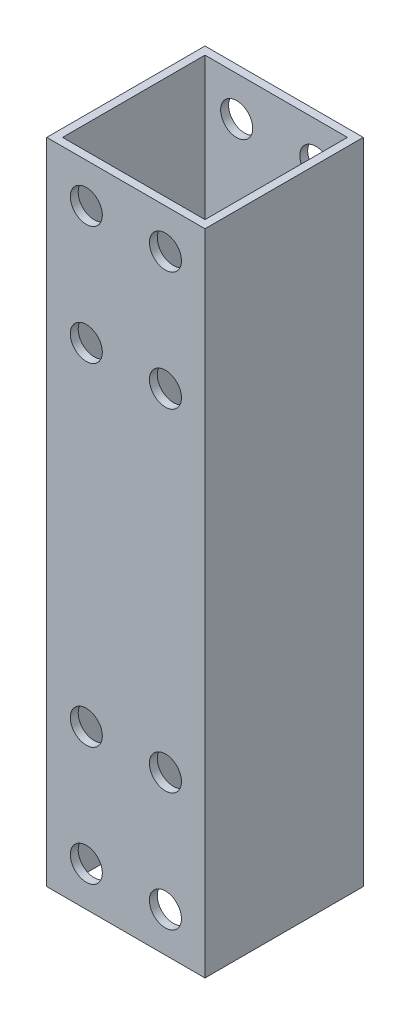
ISO-10303-21;
HEADER;
FILE_DESCRIPTION(('STEP AP214'),'2;1');
FILE_NAME('part.step','',(''),(''),'','','');
FILE_SCHEMA(('AUTOMOTIVE_DESIGN { 1 0 10303 214 1 1 1 1 }'));
ENDSEC;
DATA;
#1=APPLICATION_CONTEXT('core data for automotive mechanical design processes');
#2=APPLICATION_PROTOCOL_DEFINITION('international standard','automotive_design',2000,#1);
#3=PRODUCT_CONTEXT('',#1,'mechanical');
#4=PRODUCT('Part','Part','',(#3));
#5=PRODUCT_RELATED_PRODUCT_CATEGORY('part','',(#4));
#6=PRODUCT_DEFINITION_FORMATION('','',#4);
#7=PRODUCT_DEFINITION_CONTEXT('part definition',#1,'design');
#8=PRODUCT_DEFINITION('design','',#6,#7);
#9=PRODUCT_DEFINITION_SHAPE('','',#8);
#10=(LENGTH_UNIT() NAMED_UNIT(*) SI_UNIT(.MILLI.,.METRE.));
#11=(NAMED_UNIT(*) PLANE_ANGLE_UNIT() SI_UNIT($,.RADIAN.));
#12=(NAMED_UNIT(*) SI_UNIT($,.STERADIAN.) SOLID_ANGLE_UNIT());
#13=UNCERTAINTY_MEASURE_WITH_UNIT(LENGTH_MEASURE(1.E-05),#10,'distance_accuracy_value','');
#14=(GEOMETRIC_REPRESENTATION_CONTEXT(3) GLOBAL_UNCERTAINTY_ASSIGNED_CONTEXT((#13)) GLOBAL_UNIT_ASSIGNED_CONTEXT((#10,
#11,#12)) REPRESENTATION_CONTEXT('',''));
#15=CARTESIAN_POINT('',(0.,0.,0.));
#16=DIRECTION('',(0.,0.,1.));
#17=DIRECTION('',(1.,0.,0.));
#18=AXIS2_PLACEMENT_3D('',#15,#16,#17);
#19=CARTESIAN_POINT('',(0.,82.,0.));
#20=DIRECTION('',(0.,1.,0.));
#21=DIRECTION('',(0.,0.,1.));
#22=AXIS2_PLACEMENT_3D('',#19,#20,#21);
#23=PLANE('',#22);
#24=DIRECTION('',(0.,0.,-1.));
#25=VECTOR('',#24,1.);
#26=CARTESIAN_POINT('',(10.,82.,-10.));
#27=LINE('',#26,#25);
#28=CARTESIAN_POINT('',(10.,82.,10.));
#29=VERTEX_POINT('',#28);
#30=CARTESIAN_POINT('',(10.,82.,-10.));
#31=VERTEX_POINT('',#30);
#32=EDGE_CURVE('E141',#29,#31,#27,.T.);
#33=ORIENTED_EDGE('',*,*,#32,.T.);
#34=DIRECTION('',(-1.,0.,0.));
#35=VECTOR('',#34,1.);
#36=CARTESIAN_POINT('',(-10.,82.,-10.));
#37=LINE('',#36,#35);
#38=CARTESIAN_POINT('',(-10.,82.,-10.));
#39=VERTEX_POINT('',#38);
#40=EDGE_CURVE('E144',#31,#39,#37,.T.);
#41=ORIENTED_EDGE('',*,*,#40,.T.);
#42=DIRECTION('',(0.,0.,1.));
#43=VECTOR('',#42,1.);
#44=CARTESIAN_POINT('',(-10.,82.,-10.));
#45=LINE('',#44,#43);
#46=CARTESIAN_POINT('',(-10.,82.,10.));
#47=VERTEX_POINT('',#46);
#48=EDGE_CURVE('E147',#39,#47,#45,.T.);
#49=ORIENTED_EDGE('',*,*,#48,.T.);
#50=DIRECTION('',(1.,0.,0.));
#51=VECTOR('',#50,1.);
#52=CARTESIAN_POINT('',(-10.,82.,10.));
#53=LINE('',#52,#51);
#54=EDGE_CURVE('E149',#47,#29,#53,.T.);
#55=ORIENTED_EDGE('',*,*,#54,.T.);
#56=EDGE_LOOP('',(#33,#41,#49,#55));
#57=FACE_BOUND('',#56,.T.);
#58=DIRECTION('',(1.,0.,0.));
#59=VECTOR('',#58,1.);
#60=CARTESIAN_POINT('',(-9.,82.,9.));
#61=LINE('',#60,#59);
#62=CARTESIAN_POINT('',(-9.,82.,9.));
#63=VERTEX_POINT('',#62);
#64=CARTESIAN_POINT('',(9.00000000000001,82.,9.));
#65=VERTEX_POINT('',#64);
#66=EDGE_CURVE('E111',#63,#65,#61,.T.);
#67=ORIENTED_EDGE('',*,*,#66,.F.);
#68=DIRECTION('',(0.,0.,1.));
#69=VECTOR('',#68,1.);
#70=CARTESIAN_POINT('',(-9.,82.,-9.));
#71=LINE('',#70,#69);
#72=CARTESIAN_POINT('',(-9.,82.,-9.));
#73=VERTEX_POINT('',#72);
#74=EDGE_CURVE('E103',#73,#63,#71,.T.);
#75=ORIENTED_EDGE('',*,*,#74,.F.);
#76=DIRECTION('',(-1.,0.,0.));
#77=VECTOR('',#76,1.);
#78=CARTESIAN_POINT('',(-9.,82.,-9.));
#79=LINE('',#78,#77);
#80=CARTESIAN_POINT('',(9.,82.,-9.));
#81=VERTEX_POINT('',#80);
#82=EDGE_CURVE('E125',#81,#73,#79,.T.);
#83=ORIENTED_EDGE('',*,*,#82,.F.);
#84=DIRECTION('',(0.,0.,-1.));
#85=VECTOR('',#84,1.);
#86=CARTESIAN_POINT('',(9.,82.,-9.));
#87=LINE('',#86,#85);
#88=EDGE_CURVE('E123',#65,#81,#87,.T.);
#89=ORIENTED_EDGE('',*,*,#88,.F.);
#90=EDGE_LOOP('',(#67,#75,#83,#89));
#91=FACE_BOUND('',#90,.T.);
#92=ADVANCED_FACE('F36',(#57,#91),#23,.T.);
#93=CARTESIAN_POINT('',(0.,0.,0.));
#94=DIRECTION('',(0.,1.,0.));
#95=DIRECTION('',(0.,0.,1.));
#96=AXIS2_PLACEMENT_3D('',#93,#94,#95);
#97=PLANE('',#96);
#98=DIRECTION('',(0.,0.,-1.));
#99=VECTOR('',#98,1.);
#100=CARTESIAN_POINT('',(10.,0.,-10.));
#101=LINE('',#100,#99);
#102=CARTESIAN_POINT('',(10.,0.,10.));
#103=VERTEX_POINT('',#102);
#104=CARTESIAN_POINT('',(10.,0.,-10.));
#105=VERTEX_POINT('',#104);
#106=EDGE_CURVE('E119',#103,#105,#101,.T.);
#107=ORIENTED_EDGE('',*,*,#106,.F.);
#108=DIRECTION('',(1.,0.,0.));
#109=VECTOR('',#108,1.);
#110=CARTESIAN_POINT('',(-10.,0.,10.));
#111=LINE('',#110,#109);
#112=CARTESIAN_POINT('',(-10.,0.,10.));
#113=VERTEX_POINT('',#112);
#114=EDGE_CURVE('E145',#113,#103,#111,.T.);
#115=ORIENTED_EDGE('',*,*,#114,.F.);
#116=DIRECTION('',(0.,0.,1.));
#117=VECTOR('',#116,1.);
#118=CARTESIAN_POINT('',(-10.,0.,-10.));
#119=LINE('',#118,#117);
#120=CARTESIAN_POINT('',(-10.,0.,-10.));
#121=VERTEX_POINT('',#120);
#122=EDGE_CURVE('E156',#121,#113,#119,.T.);
#123=ORIENTED_EDGE('',*,*,#122,.F.);
#124=DIRECTION('',(-1.,0.,0.));
#125=VECTOR('',#124,1.);
#126=CARTESIAN_POINT('',(-10.,0.,-10.));
#127=LINE('',#126,#125);
#128=EDGE_CURVE('E154',#105,#121,#127,.T.);
#129=ORIENTED_EDGE('',*,*,#128,.F.);
#130=EDGE_LOOP('',(#107,#115,#123,#129));
#131=FACE_BOUND('',#130,.T.);
#132=DIRECTION('',(0.,0.,1.));
#133=VECTOR('',#132,1.);
#134=CARTESIAN_POINT('',(-9.,0.,-9.));
#135=LINE('',#134,#133);
#136=CARTESIAN_POINT('',(-9.,0.,-9.));
#137=VERTEX_POINT('',#136);
#138=CARTESIAN_POINT('',(-9.,0.,9.));
#139=VERTEX_POINT('',#138);
#140=EDGE_CURVE('E61',#137,#139,#135,.T.);
#141=ORIENTED_EDGE('',*,*,#140,.T.);
#142=DIRECTION('',(1.,0.,0.));
#143=VECTOR('',#142,1.);
#144=CARTESIAN_POINT('',(-9.,0.,9.));
#145=LINE('',#144,#143);
#146=CARTESIAN_POINT('',(9.00000000000001,0.,9.));
#147=VERTEX_POINT('',#146);
#148=EDGE_CURVE('E118',#139,#147,#145,.T.);
#149=ORIENTED_EDGE('',*,*,#148,.T.);
#150=DIRECTION('',(0.,0.,-1.));
#151=VECTOR('',#150,1.);
#152=CARTESIAN_POINT('',(9.,0.,-9.));
#153=LINE('',#152,#151);
#154=CARTESIAN_POINT('',(9.,0.,-9.));
#155=VERTEX_POINT('',#154);
#156=EDGE_CURVE('E133',#147,#155,#153,.T.);
#157=ORIENTED_EDGE('',*,*,#156,.T.);
#158=DIRECTION('',(-1.,0.,0.));
#159=VECTOR('',#158,1.);
#160=CARTESIAN_POINT('',(-9.,0.,-9.));
#161=LINE('',#160,#159);
#162=EDGE_CURVE('E112',#155,#137,#161,.T.);
#163=ORIENTED_EDGE('',*,*,#162,.T.);
#164=EDGE_LOOP('',(#141,#149,#157,#163));
#165=FACE_BOUND('',#164,.T.);
#166=ADVANCED_FACE('F232',(#131,#165),#97,.F.);
#167=CARTESIAN_POINT('',(10.,82.,-10.));
#168=DIRECTION('',(-1.,0.,0.));
#169=DIRECTION('',(0.,0.,1.));
#170=AXIS2_PLACEMENT_3D('',#167,#168,#169);
#171=PLANE('',#170);
#172=ORIENTED_EDGE('',*,*,#106,.T.);
#173=DIRECTION('',(0.,-1.,0.));
#174=VECTOR('',#173,1.);
#175=CARTESIAN_POINT('',(10.,82.,-10.));
#176=LINE('',#175,#174);
#177=EDGE_CURVE('E11',#31,#105,#176,.T.);
#178=ORIENTED_EDGE('',*,*,#177,.F.);
#179=ORIENTED_EDGE('',*,*,#32,.F.);
#180=DIRECTION('',(0.,-1.,0.));
#181=VECTOR('',#180,1.);
#182=CARTESIAN_POINT('',(10.,82.,10.));
#183=LINE('',#182,#181);
#184=EDGE_CURVE('E151',#29,#103,#183,.T.);
#185=ORIENTED_EDGE('',*,*,#184,.T.);
#186=EDGE_LOOP('',(#172,#178,#179,#185));
#187=FACE_BOUND('',#186,.T.);
#188=ADVANCED_FACE('F38',(#187),#171,.F.);
#189=CARTESIAN_POINT('',(-10.,82.,-10.));
#190=DIRECTION('',(0.,0.,1.));
#191=DIRECTION('',(1.,0.,0.));
#192=AXIS2_PLACEMENT_3D('',#189,#190,#191);
#193=PLANE('',#192);
#194=CARTESIAN_POINT('',(5.,77.,-10.));
#195=DIRECTION('',(0.,0.,1.));
#196=DIRECTION('',(1.,0.,0.));
#197=AXIS2_PLACEMENT_3D('',#194,#195,#196);
#198=CIRCLE('',#197,2.025);
#199=CARTESIAN_POINT('',(7.025,77.,-10.));
#200=VERTEX_POINT('',#199);
#201=EDGE_CURVE('E268',#200,#200,#198,.T.);
#202=ORIENTED_EDGE('',*,*,#201,.T.);
#203=EDGE_LOOP('',(#202));
#204=FACE_BOUND('',#203,.T.);
#205=CARTESIAN_POINT('',(5.,4.99999999999999,-10.));
#206=DIRECTION('',(0.,0.,1.));
#207=DIRECTION('',(1.,0.,0.));
#208=AXIS2_PLACEMENT_3D('',#205,#206,#207);
#209=CIRCLE('',#208,2.025);
#210=CARTESIAN_POINT('',(7.025,4.99999999999999,-10.));
#211=VERTEX_POINT('',#210);
#212=EDGE_CURVE('E272',#211,#211,#209,.T.);
#213=ORIENTED_EDGE('',*,*,#212,.T.);
#214=EDGE_LOOP('',(#213));
#215=FACE_BOUND('',#214,.T.);
#216=CARTESIAN_POINT('',(5.,20.,-10.));
#217=DIRECTION('',(0.,0.,1.));
#218=DIRECTION('',(1.,0.,0.));
#219=AXIS2_PLACEMENT_3D('',#216,#217,#218);
#220=CIRCLE('',#219,2.025);
#221=CARTESIAN_POINT('',(7.025,20.,-10.));
#222=VERTEX_POINT('',#221);
#223=EDGE_CURVE('E276',#222,#222,#220,.T.);
#224=ORIENTED_EDGE('',*,*,#223,.T.);
#225=EDGE_LOOP('',(#224));
#226=FACE_BOUND('',#225,.T.);
#227=CARTESIAN_POINT('',(-5.,20.,-10.));
#228=DIRECTION('',(0.,0.,1.));
#229=DIRECTION('',(1.,0.,0.));
#230=AXIS2_PLACEMENT_3D('',#227,#228,#229);
#231=CIRCLE('',#230,2.025);
#232=CARTESIAN_POINT('',(-2.975,20.,-10.));
#233=VERTEX_POINT('',#232);
#234=EDGE_CURVE('E280',#233,#233,#231,.T.);
#235=ORIENTED_EDGE('',*,*,#234,.T.);
#236=EDGE_LOOP('',(#235));
#237=FACE_BOUND('',#236,.T.);
#238=CARTESIAN_POINT('',(5.,62.,-10.));
#239=DIRECTION('',(0.,0.,1.));
#240=DIRECTION('',(1.,0.,0.));
#241=AXIS2_PLACEMENT_3D('',#238,#239,#240);
#242=CIRCLE('',#241,2.025);
#243=CARTESIAN_POINT('',(7.025,62.,-10.));
#244=VERTEX_POINT('',#243);
#245=EDGE_CURVE('E284',#244,#244,#242,.T.);
#246=ORIENTED_EDGE('',*,*,#245,.T.);
#247=EDGE_LOOP('',(#246));
#248=FACE_BOUND('',#247,.T.);
#249=CARTESIAN_POINT('',(-5.,62.,-10.));
#250=DIRECTION('',(0.,0.,1.));
#251=DIRECTION('',(1.,0.,0.));
#252=AXIS2_PLACEMENT_3D('',#249,#250,#251);
#253=CIRCLE('',#252,2.025);
#254=CARTESIAN_POINT('',(-2.975,62.,-10.));
#255=VERTEX_POINT('',#254);
#256=EDGE_CURVE('E288',#255,#255,#253,.T.);
#257=ORIENTED_EDGE('',*,*,#256,.T.);
#258=EDGE_LOOP('',(#257));
#259=FACE_BOUND('',#258,.T.);
#260=CARTESIAN_POINT('',(-5.,77.,-10.));
#261=DIRECTION('',(0.,0.,1.));
#262=DIRECTION('',(1.,0.,0.));
#263=AXIS2_PLACEMENT_3D('',#260,#261,#262);
#264=CIRCLE('',#263,2.025);
#265=CARTESIAN_POINT('',(-2.975,77.,-10.));
#266=VERTEX_POINT('',#265);
#267=EDGE_CURVE('E292',#266,#266,#264,.T.);
#268=ORIENTED_EDGE('',*,*,#267,.T.);
#269=EDGE_LOOP('',(#268));
#270=FACE_BOUND('',#269,.T.);
#271=CARTESIAN_POINT('',(-5.,5.,-10.));
#272=DIRECTION('',(0.,0.,1.));
#273=DIRECTION('',(1.,0.,0.));
#274=AXIS2_PLACEMENT_3D('',#271,#272,#273);
#275=CIRCLE('',#274,2.025);
#276=CARTESIAN_POINT('',(-2.975,5.,-10.));
#277=VERTEX_POINT('',#276);
#278=EDGE_CURVE('E170',#277,#277,#275,.T.);
#279=ORIENTED_EDGE('',*,*,#278,.T.);
#280=EDGE_LOOP('',(#279));
#281=FACE_BOUND('',#280,.T.);
#282=ORIENTED_EDGE('',*,*,#128,.T.);
#283=DIRECTION('',(0.,-1.,0.));
#284=VECTOR('',#283,1.);
#285=CARTESIAN_POINT('',(-10.,82.,-10.));
#286=LINE('',#285,#284);
#287=EDGE_CURVE('E45',#39,#121,#286,.T.);
#288=ORIENTED_EDGE('',*,*,#287,.F.);
#289=ORIENTED_EDGE('',*,*,#40,.F.);
#290=ORIENTED_EDGE('',*,*,#177,.T.);
#291=EDGE_LOOP('',(#282,#288,#289,#290));
#292=FACE_BOUND('',#291,.T.);
#293=ADVANCED_FACE('F257',(#204,#215,#226,#237,#248,#259,#270,#281,#292),#193,.F.);
#294=CARTESIAN_POINT('',(-10.,82.,-10.));
#295=DIRECTION('',(1.,0.,0.));
#296=DIRECTION('',(0.,0.,-1.));
#297=AXIS2_PLACEMENT_3D('',#294,#295,#296);
#298=PLANE('',#297);
#299=ORIENTED_EDGE('',*,*,#122,.T.);
#300=DIRECTION('',(0.,-1.,0.));
#301=VECTOR('',#300,1.);
#302=CARTESIAN_POINT('',(-10.,82.,10.));
#303=LINE('',#302,#301);
#304=EDGE_CURVE('E161',#47,#113,#303,.T.);
#305=ORIENTED_EDGE('',*,*,#304,.F.);
#306=ORIENTED_EDGE('',*,*,#48,.F.);
#307=ORIENTED_EDGE('',*,*,#287,.T.);
#308=EDGE_LOOP('',(#299,#305,#306,#307));
#309=FACE_BOUND('',#308,.T.);
#310=ADVANCED_FACE('F254',(#309),#298,.F.);
#311=CARTESIAN_POINT('',(-10.,82.,10.));
#312=DIRECTION('',(0.,0.,-1.));
#313=DIRECTION('',(-1.,0.,0.));
#314=AXIS2_PLACEMENT_3D('',#311,#312,#313);
#315=PLANE('',#314);
#316=CARTESIAN_POINT('',(5.,77.,10.));
#317=DIRECTION('',(0.,0.,1.));
#318=DIRECTION('',(1.,0.,0.));
#319=AXIS2_PLACEMENT_3D('',#316,#317,#318);
#320=CIRCLE('',#319,2.025);
#321=CARTESIAN_POINT('',(7.025,77.,10.));
#322=VERTEX_POINT('',#321);
#323=EDGE_CURVE('E404',#322,#322,#320,.T.);
#324=ORIENTED_EDGE('',*,*,#323,.F.);
#325=EDGE_LOOP('',(#324));
#326=FACE_BOUND('',#325,.T.);
#327=CARTESIAN_POINT('',(5.,4.99999999999999,10.));
#328=DIRECTION('',(0.,0.,1.));
#329=DIRECTION('',(1.,0.,0.));
#330=AXIS2_PLACEMENT_3D('',#327,#328,#329);
#331=CIRCLE('',#330,2.025);
#332=CARTESIAN_POINT('',(7.025,4.99999999999999,10.));
#333=VERTEX_POINT('',#332);
#334=EDGE_CURVE('E395',#333,#333,#331,.T.);
#335=ORIENTED_EDGE('',*,*,#334,.F.);
#336=EDGE_LOOP('',(#335));
#337=FACE_BOUND('',#336,.T.);
#338=CARTESIAN_POINT('',(5.,20.,10.));
#339=DIRECTION('',(0.,0.,1.));
#340=DIRECTION('',(1.,0.,0.));
#341=AXIS2_PLACEMENT_3D('',#338,#339,#340);
#342=CIRCLE('',#341,2.025);
#343=CARTESIAN_POINT('',(7.025,20.,10.));
#344=VERTEX_POINT('',#343);
#345=EDGE_CURVE('E313',#344,#344,#342,.T.);
#346=ORIENTED_EDGE('',*,*,#345,.F.);
#347=EDGE_LOOP('',(#346));
#348=FACE_BOUND('',#347,.T.);
#349=CARTESIAN_POINT('',(-5.,20.,10.));
#350=DIRECTION('',(0.,0.,1.));
#351=DIRECTION('',(1.,0.,0.));
#352=AXIS2_PLACEMENT_3D('',#349,#350,#351);
#353=CIRCLE('',#352,2.025);
#354=CARTESIAN_POINT('',(-2.975,20.,10.));
#355=VERTEX_POINT('',#354);
#356=EDGE_CURVE('E394',#355,#355,#353,.T.);
#357=ORIENTED_EDGE('',*,*,#356,.F.);
#358=EDGE_LOOP('',(#357));
#359=FACE_BOUND('',#358,.T.);
#360=CARTESIAN_POINT('',(5.,62.,10.));
#361=DIRECTION('',(0.,0.,1.));
#362=DIRECTION('',(1.,0.,0.));
#363=AXIS2_PLACEMENT_3D('',#360,#361,#362);
#364=CIRCLE('',#363,2.025);
#365=CARTESIAN_POINT('',(7.025,62.,10.));
#366=VERTEX_POINT('',#365);
#367=EDGE_CURVE('E416',#366,#366,#364,.T.);
#368=ORIENTED_EDGE('',*,*,#367,.F.);
#369=EDGE_LOOP('',(#368));
#370=FACE_BOUND('',#369,.T.);
#371=CARTESIAN_POINT('',(-5.,62.,10.));
#372=DIRECTION('',(0.,0.,1.));
#373=DIRECTION('',(1.,0.,0.));
#374=AXIS2_PLACEMENT_3D('',#371,#372,#373);
#375=CIRCLE('',#374,2.025);
#376=CARTESIAN_POINT('',(-2.975,62.,10.));
#377=VERTEX_POINT('',#376);
#378=EDGE_CURVE('E420',#377,#377,#375,.T.);
#379=ORIENTED_EDGE('',*,*,#378,.F.);
#380=EDGE_LOOP('',(#379));
#381=FACE_BOUND('',#380,.T.);
#382=CARTESIAN_POINT('',(-5.,77.,10.));
#383=DIRECTION('',(0.,0.,1.));
#384=DIRECTION('',(1.,0.,0.));
#385=AXIS2_PLACEMENT_3D('',#382,#383,#384);
#386=CIRCLE('',#385,2.025);
#387=CARTESIAN_POINT('',(-2.975,77.,10.));
#388=VERTEX_POINT('',#387);
#389=EDGE_CURVE('E400',#388,#388,#386,.T.);
#390=ORIENTED_EDGE('',*,*,#389,.F.);
#391=EDGE_LOOP('',(#390));
#392=FACE_BOUND('',#391,.T.);
#393=CARTESIAN_POINT('',(-5.,5.,10.));
#394=DIRECTION('',(0.,0.,1.));
#395=DIRECTION('',(1.,0.,0.));
#396=AXIS2_PLACEMENT_3D('',#393,#394,#395);
#397=CIRCLE('',#396,2.025);
#398=CARTESIAN_POINT('',(-2.975,5.,10.));
#399=VERTEX_POINT('',#398);
#400=EDGE_CURVE('E308',#399,#399,#397,.T.);
#401=ORIENTED_EDGE('',*,*,#400,.F.);
#402=EDGE_LOOP('',(#401));
#403=FACE_BOUND('',#402,.T.);
#404=ORIENTED_EDGE('',*,*,#114,.T.);
#405=ORIENTED_EDGE('',*,*,#184,.F.);
#406=ORIENTED_EDGE('',*,*,#54,.F.);
#407=ORIENTED_EDGE('',*,*,#304,.T.);
#408=EDGE_LOOP('',(#404,#405,#406,#407));
#409=FACE_BOUND('',#408,.T.);
#410=ADVANCED_FACE('F251',(#326,#337,#348,#359,#370,#381,#392,#403,#409),#315,.F.);
#411=CARTESIAN_POINT('',(-9.,82.,-9.));
#412=DIRECTION('',(1.,0.,0.));
#413=DIRECTION('',(0.,0.,-1.));
#414=AXIS2_PLACEMENT_3D('',#411,#412,#413);
#415=PLANE('',#414);
#416=ORIENTED_EDGE('',*,*,#140,.F.);
#417=DIRECTION('',(0.,-1.,0.));
#418=VECTOR('',#417,1.);
#419=CARTESIAN_POINT('',(-9.,82.,-9.));
#420=LINE('',#419,#418);
#421=EDGE_CURVE('E107',#73,#137,#420,.T.);
#422=ORIENTED_EDGE('',*,*,#421,.F.);
#423=ORIENTED_EDGE('',*,*,#74,.T.);
#424=DIRECTION('',(0.,-1.,0.));
#425=VECTOR('',#424,1.);
#426=CARTESIAN_POINT('',(-9.,82.,9.));
#427=LINE('',#426,#425);
#428=EDGE_CURVE('E106',#63,#139,#427,.T.);
#429=ORIENTED_EDGE('',*,*,#428,.T.);
#430=EDGE_LOOP('',(#416,#422,#423,#429));
#431=FACE_BOUND('',#430,.T.);
#432=ADVANCED_FACE('F105',(#431),#415,.T.);
#433=CARTESIAN_POINT('',(-9.,82.,9.));
#434=DIRECTION('',(0.,0.,-1.));
#435=DIRECTION('',(-1.,0.,0.));
#436=AXIS2_PLACEMENT_3D('',#433,#434,#435);
#437=PLANE('',#436);
#438=CARTESIAN_POINT('',(5.,77.,9.));
#439=DIRECTION('',(0.,0.,-1.));
#440=DIRECTION('',(-1.,0.,0.));
#441=AXIS2_PLACEMENT_3D('',#438,#439,#440);
#442=CIRCLE('',#441,2.025);
#443=CARTESIAN_POINT('',(2.975,77.,9.));
#444=VERTEX_POINT('',#443);
#445=EDGE_CURVE('E131',#444,#444,#442,.T.);
#446=ORIENTED_EDGE('',*,*,#445,.F.);
#447=EDGE_LOOP('',(#446));
#448=FACE_BOUND('',#447,.T.);
#449=CARTESIAN_POINT('',(5.,4.99999999999999,9.));
#450=DIRECTION('',(0.,0.,-1.));
#451=DIRECTION('',(-1.,0.,0.));
#452=AXIS2_PLACEMENT_3D('',#449,#450,#451);
#453=CIRCLE('',#452,2.025);
#454=CARTESIAN_POINT('',(2.975,4.99999999999999,9.));
#455=VERTEX_POINT('',#454);
#456=EDGE_CURVE('E192',#455,#455,#453,.T.);
#457=ORIENTED_EDGE('',*,*,#456,.F.);
#458=EDGE_LOOP('',(#457));
#459=FACE_BOUND('',#458,.T.);
#460=CARTESIAN_POINT('',(5.,20.,9.));
#461=DIRECTION('',(0.,0.,-1.));
#462=DIRECTION('',(-1.,0.,0.));
#463=AXIS2_PLACEMENT_3D('',#460,#461,#462);
#464=CIRCLE('',#463,2.025);
#465=CARTESIAN_POINT('',(2.975,20.,9.));
#466=VERTEX_POINT('',#465);
#467=EDGE_CURVE('E189',#466,#466,#464,.T.);
#468=ORIENTED_EDGE('',*,*,#467,.F.);
#469=EDGE_LOOP('',(#468));
#470=FACE_BOUND('',#469,.T.);
#471=CARTESIAN_POINT('',(-5.,20.,9.));
#472=DIRECTION('',(0.,0.,-1.));
#473=DIRECTION('',(-1.,0.,0.));
#474=AXIS2_PLACEMENT_3D('',#471,#472,#473);
#475=CIRCLE('',#474,2.025);
#476=CARTESIAN_POINT('',(-7.025,20.,9.));
#477=VERTEX_POINT('',#476);
#478=EDGE_CURVE('E186',#477,#477,#475,.T.);
#479=ORIENTED_EDGE('',*,*,#478,.F.);
#480=EDGE_LOOP('',(#479));
#481=FACE_BOUND('',#480,.T.);
#482=CARTESIAN_POINT('',(5.,62.,9.));
#483=DIRECTION('',(0.,0.,-1.));
#484=DIRECTION('',(-1.,0.,0.));
#485=AXIS2_PLACEMENT_3D('',#482,#483,#484);
#486=CIRCLE('',#485,2.025);
#487=CARTESIAN_POINT('',(2.975,62.,9.));
#488=VERTEX_POINT('',#487);
#489=EDGE_CURVE('E182',#488,#488,#486,.T.);
#490=ORIENTED_EDGE('',*,*,#489,.F.);
#491=EDGE_LOOP('',(#490));
#492=FACE_BOUND('',#491,.T.);
#493=CARTESIAN_POINT('',(-5.,62.,9.));
#494=DIRECTION('',(0.,0.,-1.));
#495=DIRECTION('',(-1.,0.,0.));
#496=AXIS2_PLACEMENT_3D('',#493,#494,#495);
#497=CIRCLE('',#496,2.025);
#498=CARTESIAN_POINT('',(-7.025,62.,9.));
#499=VERTEX_POINT('',#498);
#500=EDGE_CURVE('E178',#499,#499,#497,.T.);
#501=ORIENTED_EDGE('',*,*,#500,.F.);
#502=EDGE_LOOP('',(#501));
#503=FACE_BOUND('',#502,.T.);
#504=CARTESIAN_POINT('',(-5.,77.,9.));
#505=DIRECTION('',(0.,0.,-1.));
#506=DIRECTION('',(-1.,0.,0.));
#507=AXIS2_PLACEMENT_3D('',#504,#505,#506);
#508=CIRCLE('',#507,2.025);
#509=CARTESIAN_POINT('',(-7.025,77.,9.));
#510=VERTEX_POINT('',#509);
#511=EDGE_CURVE('E174',#510,#510,#508,.T.);
#512=ORIENTED_EDGE('',*,*,#511,.F.);
#513=EDGE_LOOP('',(#512));
#514=FACE_BOUND('',#513,.T.);
#515=CARTESIAN_POINT('',(-5.,5.,9.));
#516=DIRECTION('',(0.,0.,-1.));
#517=DIRECTION('',(-1.,0.,0.));
#518=AXIS2_PLACEMENT_3D('',#515,#516,#517);
#519=CIRCLE('',#518,2.025);
#520=CARTESIAN_POINT('',(-7.025,5.,9.));
#521=VERTEX_POINT('',#520);
#522=EDGE_CURVE('E169',#521,#521,#519,.T.);
#523=ORIENTED_EDGE('',*,*,#522,.F.);
#524=EDGE_LOOP('',(#523));
#525=FACE_BOUND('',#524,.T.);
#526=ORIENTED_EDGE('',*,*,#148,.F.);
#527=ORIENTED_EDGE('',*,*,#428,.F.);
#528=ORIENTED_EDGE('',*,*,#66,.T.);
#529=DIRECTION('',(0.,-1.,0.));
#530=VECTOR('',#529,1.);
#531=CARTESIAN_POINT('',(9.00000000000001,82.,9.));
#532=LINE('',#531,#530);
#533=EDGE_CURVE('E120',#65,#147,#532,.T.);
#534=ORIENTED_EDGE('',*,*,#533,.T.);
#535=EDGE_LOOP('',(#526,#527,#528,#534));
#536=FACE_BOUND('',#535,.T.);
#537=ADVANCED_FACE('F115',(#448,#459,#470,#481,#492,#503,#514,#525,#536),#437,.T.);
#538=CARTESIAN_POINT('',(9.,82.,-9.));
#539=DIRECTION('',(-1.,0.,0.));
#540=DIRECTION('',(0.,0.,1.));
#541=AXIS2_PLACEMENT_3D('',#538,#539,#540);
#542=PLANE('',#541);
#543=ORIENTED_EDGE('',*,*,#156,.F.);
#544=ORIENTED_EDGE('',*,*,#533,.F.);
#545=ORIENTED_EDGE('',*,*,#88,.T.);
#546=DIRECTION('',(0.,-1.,0.));
#547=VECTOR('',#546,1.);
#548=CARTESIAN_POINT('',(9.,82.,-9.));
#549=LINE('',#548,#547);
#550=EDGE_CURVE('E53',#81,#155,#549,.T.);
#551=ORIENTED_EDGE('',*,*,#550,.T.);
#552=EDGE_LOOP('',(#543,#544,#545,#551));
#553=FACE_BOUND('',#552,.T.);
#554=ADVANCED_FACE('F216',(#553),#542,.T.);
#555=CARTESIAN_POINT('',(-9.,82.,-9.));
#556=DIRECTION('',(0.,0.,1.));
#557=DIRECTION('',(1.,0.,0.));
#558=AXIS2_PLACEMENT_3D('',#555,#556,#557);
#559=PLANE('',#558);
#560=CARTESIAN_POINT('',(5.,77.,-9.));
#561=DIRECTION('',(0.,0.,1.));
#562=DIRECTION('',(1.,0.,0.));
#563=AXIS2_PLACEMENT_3D('',#560,#561,#562);
#564=CIRCLE('',#563,2.025);
#565=CARTESIAN_POINT('',(7.025,77.,-9.));
#566=VERTEX_POINT('',#565);
#567=EDGE_CURVE('E40',#566,#566,#564,.T.);
#568=ORIENTED_EDGE('',*,*,#567,.F.);
#569=EDGE_LOOP('',(#568));
#570=FACE_BOUND('',#569,.T.);
#571=CARTESIAN_POINT('',(5.,4.99999999999999,-9.));
#572=DIRECTION('',(0.,0.,1.));
#573=DIRECTION('',(1.,0.,0.));
#574=AXIS2_PLACEMENT_3D('',#571,#572,#573);
#575=CIRCLE('',#574,2.025);
#576=CARTESIAN_POINT('',(7.025,4.99999999999999,-9.));
#577=VERTEX_POINT('',#576);
#578=EDGE_CURVE('E190',#577,#577,#575,.T.);
#579=ORIENTED_EDGE('',*,*,#578,.F.);
#580=EDGE_LOOP('',(#579));
#581=FACE_BOUND('',#580,.T.);
#582=CARTESIAN_POINT('',(5.,20.,-9.));
#583=DIRECTION('',(0.,0.,1.));
#584=DIRECTION('',(1.,0.,0.));
#585=AXIS2_PLACEMENT_3D('',#582,#583,#584);
#586=CIRCLE('',#585,2.025);
#587=CARTESIAN_POINT('',(7.025,20.,-9.));
#588=VERTEX_POINT('',#587);
#589=EDGE_CURVE('E187',#588,#588,#586,.T.);
#590=ORIENTED_EDGE('',*,*,#589,.F.);
#591=EDGE_LOOP('',(#590));
#592=FACE_BOUND('',#591,.T.);
#593=CARTESIAN_POINT('',(-5.,20.,-9.));
#594=DIRECTION('',(0.,0.,1.));
#595=DIRECTION('',(1.,0.,0.));
#596=AXIS2_PLACEMENT_3D('',#593,#594,#595);
#597=CIRCLE('',#596,2.025);
#598=CARTESIAN_POINT('',(-2.975,20.,-9.));
#599=VERTEX_POINT('',#598);
#600=EDGE_CURVE('E183',#599,#599,#597,.T.);
#601=ORIENTED_EDGE('',*,*,#600,.F.);
#602=EDGE_LOOP('',(#601));
#603=FACE_BOUND('',#602,.T.);
#604=CARTESIAN_POINT('',(5.,62.,-9.));
#605=DIRECTION('',(0.,0.,1.));
#606=DIRECTION('',(1.,0.,0.));
#607=AXIS2_PLACEMENT_3D('',#604,#605,#606);
#608=CIRCLE('',#607,2.025);
#609=CARTESIAN_POINT('',(7.025,62.,-9.));
#610=VERTEX_POINT('',#609);
#611=EDGE_CURVE('E179',#610,#610,#608,.T.);
#612=ORIENTED_EDGE('',*,*,#611,.F.);
#613=EDGE_LOOP('',(#612));
#614=FACE_BOUND('',#613,.T.);
#615=CARTESIAN_POINT('',(-5.,62.,-9.));
#616=DIRECTION('',(0.,0.,1.));
#617=DIRECTION('',(1.,0.,0.));
#618=AXIS2_PLACEMENT_3D('',#615,#616,#617);
#619=CIRCLE('',#618,2.025);
#620=CARTESIAN_POINT('',(-2.975,62.,-9.));
#621=VERTEX_POINT('',#620);
#622=EDGE_CURVE('E175',#621,#621,#619,.T.);
#623=ORIENTED_EDGE('',*,*,#622,.F.);
#624=EDGE_LOOP('',(#623));
#625=FACE_BOUND('',#624,.T.);
#626=CARTESIAN_POINT('',(-5.,77.,-9.));
#627=DIRECTION('',(0.,0.,1.));
#628=DIRECTION('',(1.,0.,0.));
#629=AXIS2_PLACEMENT_3D('',#626,#627,#628);
#630=CIRCLE('',#629,2.025);
#631=CARTESIAN_POINT('',(-2.975,77.,-9.));
#632=VERTEX_POINT('',#631);
#633=EDGE_CURVE('E171',#632,#632,#630,.T.);
#634=ORIENTED_EDGE('',*,*,#633,.F.);
#635=EDGE_LOOP('',(#634));
#636=FACE_BOUND('',#635,.T.);
#637=CARTESIAN_POINT('',(-5.,5.,-9.));
#638=DIRECTION('',(0.,0.,1.));
#639=DIRECTION('',(1.,0.,0.));
#640=AXIS2_PLACEMENT_3D('',#637,#638,#639);
#641=CIRCLE('',#640,2.025);
#642=CARTESIAN_POINT('',(-2.975,5.,-9.));
#643=VERTEX_POINT('',#642);
#644=EDGE_CURVE('E166',#643,#643,#641,.T.);
#645=ORIENTED_EDGE('',*,*,#644,.F.);
#646=EDGE_LOOP('',(#645));
#647=FACE_BOUND('',#646,.T.);
#648=ORIENTED_EDGE('',*,*,#162,.F.);
#649=ORIENTED_EDGE('',*,*,#550,.F.);
#650=ORIENTED_EDGE('',*,*,#82,.T.);
#651=ORIENTED_EDGE('',*,*,#421,.T.);
#652=EDGE_LOOP('',(#648,#649,#650,#651));
#653=FACE_BOUND('',#652,.T.);
#654=ADVANCED_FACE('F212',(#570,#581,#592,#603,#614,#625,#636,#647,#653),#559,.T.);
#655=CARTESIAN_POINT('',(-5.,5.,-10.));
#656=DIRECTION('',(0.,0.,1.));
#657=DIRECTION('',(1.,0.,0.));
#658=AXIS2_PLACEMENT_3D('',#655,#656,#657);
#659=CYLINDRICAL_SURFACE('',#658,2.025);
#660=ORIENTED_EDGE('',*,*,#644,.T.);
#661=EDGE_LOOP('',(#660));
#662=FACE_BOUND('',#661,.T.);
#663=ORIENTED_EDGE('',*,*,#278,.F.);
#664=EDGE_LOOP('',(#663));
#665=FACE_BOUND('',#664,.T.);
#666=ADVANCED_FACE('F215',(#662,#665),#659,.F.);
#667=CARTESIAN_POINT('',(-5.,77.,-10.));
#668=DIRECTION('',(0.,0.,1.));
#669=DIRECTION('',(1.,0.,0.));
#670=AXIS2_PLACEMENT_3D('',#667,#668,#669);
#671=CYLINDRICAL_SURFACE('',#670,2.025);
#672=ORIENTED_EDGE('',*,*,#633,.T.);
#673=EDGE_LOOP('',(#672));
#674=FACE_BOUND('',#673,.T.);
#675=ORIENTED_EDGE('',*,*,#267,.F.);
#676=EDGE_LOOP('',(#675));
#677=FACE_BOUND('',#676,.T.);
#678=ADVANCED_FACE('F348',(#674,#677),#671,.F.);
#679=CARTESIAN_POINT('',(-5.,62.,-10.));
#680=DIRECTION('',(0.,0.,1.));
#681=DIRECTION('',(1.,0.,0.));
#682=AXIS2_PLACEMENT_3D('',#679,#680,#681);
#683=CYLINDRICAL_SURFACE('',#682,2.025);
#684=ORIENTED_EDGE('',*,*,#622,.T.);
#685=EDGE_LOOP('',(#684));
#686=FACE_BOUND('',#685,.T.);
#687=ORIENTED_EDGE('',*,*,#256,.F.);
#688=EDGE_LOOP('',(#687));
#689=FACE_BOUND('',#688,.T.);
#690=ADVANCED_FACE('F358',(#686,#689),#683,.F.);
#691=CARTESIAN_POINT('',(5.,62.,-10.));
#692=DIRECTION('',(0.,0.,1.));
#693=DIRECTION('',(1.,0.,0.));
#694=AXIS2_PLACEMENT_3D('',#691,#692,#693);
#695=CYLINDRICAL_SURFACE('',#694,2.025);
#696=ORIENTED_EDGE('',*,*,#611,.T.);
#697=EDGE_LOOP('',(#696));
#698=FACE_BOUND('',#697,.T.);
#699=ORIENTED_EDGE('',*,*,#245,.F.);
#700=EDGE_LOOP('',(#699));
#701=FACE_BOUND('',#700,.T.);
#702=ADVANCED_FACE('F363',(#698,#701),#695,.F.);
#703=CARTESIAN_POINT('',(-5.,20.,-10.));
#704=DIRECTION('',(0.,0.,1.));
#705=DIRECTION('',(1.,0.,0.));
#706=AXIS2_PLACEMENT_3D('',#703,#704,#705);
#707=CYLINDRICAL_SURFACE('',#706,2.025);
#708=ORIENTED_EDGE('',*,*,#600,.T.);
#709=EDGE_LOOP('',(#708));
#710=FACE_BOUND('',#709,.T.);
#711=ORIENTED_EDGE('',*,*,#234,.F.);
#712=EDGE_LOOP('',(#711));
#713=FACE_BOUND('',#712,.T.);
#714=ADVANCED_FACE('F373',(#710,#713),#707,.F.);
#715=CARTESIAN_POINT('',(5.,20.,-10.));
#716=DIRECTION('',(0.,0.,1.));
#717=DIRECTION('',(1.,0.,0.));
#718=AXIS2_PLACEMENT_3D('',#715,#716,#717);
#719=CYLINDRICAL_SURFACE('',#718,2.025);
#720=ORIENTED_EDGE('',*,*,#589,.T.);
#721=EDGE_LOOP('',(#720));
#722=FACE_BOUND('',#721,.T.);
#723=ORIENTED_EDGE('',*,*,#223,.F.);
#724=EDGE_LOOP('',(#723));
#725=FACE_BOUND('',#724,.T.);
#726=ADVANCED_FACE('F370',(#722,#725),#719,.F.);
#727=CARTESIAN_POINT('',(5.,4.99999999999999,-10.));
#728=DIRECTION('',(0.,0.,1.));
#729=DIRECTION('',(1.,0.,0.));
#730=AXIS2_PLACEMENT_3D('',#727,#728,#729);
#731=CYLINDRICAL_SURFACE('',#730,2.025);
#732=ORIENTED_EDGE('',*,*,#578,.T.);
#733=EDGE_LOOP('',(#732));
#734=FACE_BOUND('',#733,.T.);
#735=ORIENTED_EDGE('',*,*,#212,.F.);
#736=EDGE_LOOP('',(#735));
#737=FACE_BOUND('',#736,.T.);
#738=ADVANCED_FACE('F349',(#734,#737),#731,.F.);
#739=CARTESIAN_POINT('',(5.,77.,-10.));
#740=DIRECTION('',(0.,0.,1.));
#741=DIRECTION('',(1.,0.,0.));
#742=AXIS2_PLACEMENT_3D('',#739,#740,#741);
#743=CYLINDRICAL_SURFACE('',#742,2.025);
#744=ORIENTED_EDGE('',*,*,#567,.T.);
#745=EDGE_LOOP('',(#744));
#746=FACE_BOUND('',#745,.T.);
#747=ORIENTED_EDGE('',*,*,#201,.F.);
#748=EDGE_LOOP('',(#747));
#749=FACE_BOUND('',#748,.T.);
#750=ADVANCED_FACE('F209',(#746,#749),#743,.F.);
#751=ORIENTED_EDGE('',*,*,#522,.T.);
#752=EDGE_LOOP('',(#751));
#753=FACE_BOUND('',#752,.T.);
#754=ORIENTED_EDGE('',*,*,#400,.T.);
#755=EDGE_LOOP('',(#754));
#756=FACE_BOUND('',#755,.T.);
#757=ADVANCED_FACE('F334',(#753,#756),#659,.F.);
#758=ORIENTED_EDGE('',*,*,#511,.T.);
#759=EDGE_LOOP('',(#758));
#760=FACE_BOUND('',#759,.T.);
#761=ORIENTED_EDGE('',*,*,#389,.T.);
#762=EDGE_LOOP('',(#761));
#763=FACE_BOUND('',#762,.T.);
#764=ADVANCED_FACE('F337',(#760,#763),#671,.F.);
#765=ORIENTED_EDGE('',*,*,#500,.T.);
#766=EDGE_LOOP('',(#765));
#767=FACE_BOUND('',#766,.T.);
#768=ORIENTED_EDGE('',*,*,#378,.T.);
#769=EDGE_LOOP('',(#768));
#770=FACE_BOUND('',#769,.T.);
#771=ADVANCED_FACE('F345',(#767,#770),#683,.F.);
#772=ORIENTED_EDGE('',*,*,#489,.T.);
#773=EDGE_LOOP('',(#772));
#774=FACE_BOUND('',#773,.T.);
#775=ORIENTED_EDGE('',*,*,#367,.T.);
#776=EDGE_LOOP('',(#775));
#777=FACE_BOUND('',#776,.T.);
#778=ADVANCED_FACE('F324',(#774,#777),#695,.F.);
#779=ORIENTED_EDGE('',*,*,#478,.T.);
#780=EDGE_LOOP('',(#779));
#781=FACE_BOUND('',#780,.T.);
#782=ORIENTED_EDGE('',*,*,#356,.T.);
#783=EDGE_LOOP('',(#782));
#784=FACE_BOUND('',#783,.T.);
#785=ADVANCED_FACE('F376',(#781,#784),#707,.F.);
#786=ORIENTED_EDGE('',*,*,#467,.T.);
#787=EDGE_LOOP('',(#786));
#788=FACE_BOUND('',#787,.T.);
#789=ORIENTED_EDGE('',*,*,#345,.T.);
#790=EDGE_LOOP('',(#789));
#791=FACE_BOUND('',#790,.T.);
#792=ADVANCED_FACE('F379',(#788,#791),#719,.F.);
#793=ORIENTED_EDGE('',*,*,#456,.T.);
#794=EDGE_LOOP('',(#793));
#795=FACE_BOUND('',#794,.T.);
#796=ORIENTED_EDGE('',*,*,#334,.T.);
#797=EDGE_LOOP('',(#796));
#798=FACE_BOUND('',#797,.T.);
#799=ADVANCED_FACE('F371',(#795,#798),#731,.F.);
#800=ORIENTED_EDGE('',*,*,#445,.T.);
#801=EDGE_LOOP('',(#800));
#802=FACE_BOUND('',#801,.T.);
#803=ORIENTED_EDGE('',*,*,#323,.T.);
#804=EDGE_LOOP('',(#803));
#805=FACE_BOUND('',#804,.T.);
#806=ADVANCED_FACE('F351',(#802,#805),#743,.F.);
#807=CLOSED_SHELL('',(#92,#166,#188,#293,#310,#410,#432,#537,#554,#654,#666,#678,#690,#702,#714,
#726,#738,#750,#757,#764,#771,#778,#785,#792,#799,#806));
#808=MANIFOLD_SOLID_BREP('B2',#807);
#809=ADVANCED_BREP_SHAPE_REPRESENTATION('',(#18,#808),#14);
#810=SHAPE_DEFINITION_REPRESENTATION(#9,#809);
ENDSEC;
END-ISO-10303-21;
